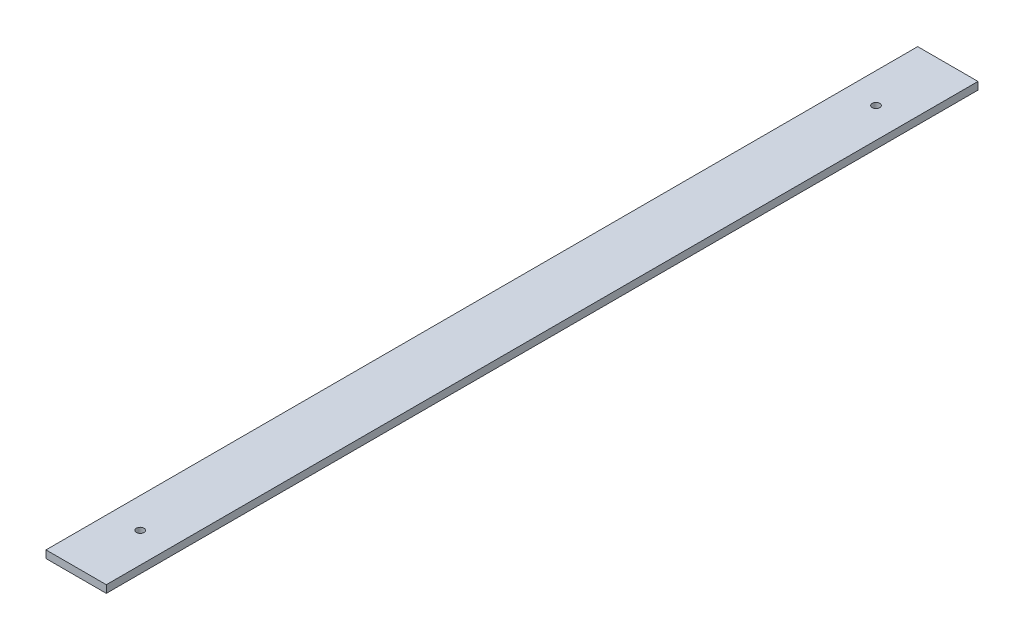
ISO-10303-21;
HEADER;
FILE_DESCRIPTION(('STEP AP214'),'2;1');
FILE_NAME('part.step','',(''),(''),'','','');
FILE_SCHEMA(('AUTOMOTIVE_DESIGN { 1 0 10303 214 1 1 1 1 }'));
ENDSEC;
DATA;
#1=APPLICATION_CONTEXT('core data for automotive mechanical design processes');
#2=APPLICATION_PROTOCOL_DEFINITION('international standard','automotive_design',2000,#1);
#3=PRODUCT_CONTEXT('',#1,'mechanical');
#4=PRODUCT('Part','Part','',(#3));
#5=PRODUCT_RELATED_PRODUCT_CATEGORY('part','',(#4));
#6=PRODUCT_DEFINITION_FORMATION('','',#4);
#7=PRODUCT_DEFINITION_CONTEXT('part definition',#1,'design');
#8=PRODUCT_DEFINITION('design','',#6,#7);
#9=PRODUCT_DEFINITION_SHAPE('','',#8);
#10=(LENGTH_UNIT() NAMED_UNIT(*) SI_UNIT(.MILLI.,.METRE.));
#11=(NAMED_UNIT(*) PLANE_ANGLE_UNIT() SI_UNIT($,.RADIAN.));
#12=(NAMED_UNIT(*) SI_UNIT($,.STERADIAN.) SOLID_ANGLE_UNIT());
#13=UNCERTAINTY_MEASURE_WITH_UNIT(LENGTH_MEASURE(1.E-05),#10,'distance_accuracy_value','');
#14=(GEOMETRIC_REPRESENTATION_CONTEXT(3) GLOBAL_UNCERTAINTY_ASSIGNED_CONTEXT((#13)) GLOBAL_UNIT_ASSIGNED_CONTEXT((#10,
#11,#12)) REPRESENTATION_CONTEXT('',''));
#15=CARTESIAN_POINT('',(0.,0.,0.));
#16=DIRECTION('',(0.,0.,1.));
#17=DIRECTION('',(1.,0.,0.));
#18=AXIS2_PLACEMENT_3D('',#15,#16,#17);
#19=CARTESIAN_POINT('',(0.,25.,0.));
#20=DIRECTION('',(0.,-1.,0.));
#21=DIRECTION('',(0.,0.,-1.));
#22=AXIS2_PLACEMENT_3D('',#19,#20,#21);
#23=PLANE('',#22);
#24=DIRECTION('',(0.,0.,-1.));
#25=VECTOR('',#24,1.);
#26=CARTESIAN_POINT('',(22132.9446458133,25.,9942.5828739722));
#27=LINE('',#26,#25);
#28=CARTESIAN_POINT('',(22132.9446458133,25.,12833.58379391));
#29=VERTEX_POINT('',#28);
#30=CARTESIAN_POINT('',(22132.9446458133,25.,9942.5828739722));
#31=VERTEX_POINT('',#30);
#32=EDGE_CURVE('E102',#29,#31,#27,.T.);
#33=ORIENTED_EDGE('',*,*,#32,.T.);
#34=DIRECTION('',(-1.,0.,0.));
#35=VECTOR('',#34,1.);
#36=CARTESIAN_POINT('',(22132.9446458133,25.,9942.5828739722));
#37=LINE('',#36,#35);
#38=CARTESIAN_POINT('',(21932.9446458133,25.,9942.5828739722));
#39=VERTEX_POINT('',#38);
#40=EDGE_CURVE('E97',#31,#39,#37,.T.);
#41=ORIENTED_EDGE('',*,*,#40,.T.);
#42=DIRECTION('',(0.,0.,1.));
#43=VECTOR('',#42,1.);
#44=CARTESIAN_POINT('',(21932.9446458133,25.,9942.5828739722));
#45=LINE('',#44,#43);
#46=CARTESIAN_POINT('',(21932.9446458133,25.,12833.58379391));
#47=VERTEX_POINT('',#46);
#48=EDGE_CURVE('E100',#39,#47,#45,.T.);
#49=ORIENTED_EDGE('',*,*,#48,.T.);
#50=DIRECTION('',(1.,0.,0.));
#51=VECTOR('',#50,1.);
#52=CARTESIAN_POINT('',(22132.9446458133,25.,12833.58379391));
#53=LINE('',#52,#51);
#54=EDGE_CURVE('E67',#47,#29,#53,.T.);
#55=ORIENTED_EDGE('',*,*,#54,.T.);
#56=EDGE_LOOP('',(#33,#41,#49,#55));
#57=FACE_BOUND('',#56,.T.);
#58=CARTESIAN_POINT('',(22032.9446458133,25.,12621.2282851754));
#59=DIRECTION('',(0.,1.,0.));
#60=DIRECTION('',(0.,0.,1.));
#61=AXIS2_PLACEMENT_3D('',#58,#59,#60);
#62=CIRCLE('',#61,12.4999999999988);
#63=CARTESIAN_POINT('',(22032.9446458133,25.,12633.7282851754));
#64=VERTEX_POINT('',#63);
#65=EDGE_CURVE('E117',#64,#64,#62,.T.);
#66=ORIENTED_EDGE('',*,*,#65,.F.);
#67=EDGE_LOOP('',(#66));
#68=FACE_BOUND('',#67,.T.);
#69=CARTESIAN_POINT('',(22032.9446458133,25.,10181.0304593336));
#70=DIRECTION('',(0.,1.,0.));
#71=DIRECTION('',(0.,0.,1.));
#72=AXIS2_PLACEMENT_3D('',#69,#70,#71);
#73=CIRCLE('',#72,12.4999999999988);
#74=CARTESIAN_POINT('',(22032.9446458133,25.,10193.5304593336));
#75=VERTEX_POINT('',#74);
#76=EDGE_CURVE('E132',#75,#75,#73,.T.);
#77=ORIENTED_EDGE('',*,*,#76,.F.);
#78=EDGE_LOOP('',(#77));
#79=FACE_BOUND('',#78,.T.);
#80=ADVANCED_FACE('F50',(#57,#68,#79),#23,.F.);
#81=CARTESIAN_POINT('',(0.,0.,0.));
#82=DIRECTION('',(0.,-1.,0.));
#83=DIRECTION('',(0.,0.,-1.));
#84=AXIS2_PLACEMENT_3D('',#81,#82,#83);
#85=PLANE('',#84);
#86=CARTESIAN_POINT('',(22032.9446458133,0.,12621.2282851754));
#87=DIRECTION('',(0.,1.,0.));
#88=DIRECTION('',(0.,0.,1.));
#89=AXIS2_PLACEMENT_3D('',#86,#87,#88);
#90=CIRCLE('',#89,12.4999999999988);
#91=CARTESIAN_POINT('',(22032.9446458133,0.,12633.7282851754));
#92=VERTEX_POINT('',#91);
#93=EDGE_CURVE('E129',#92,#92,#90,.T.);
#94=ORIENTED_EDGE('',*,*,#93,.T.);
#95=EDGE_LOOP('',(#94));
#96=FACE_BOUND('',#95,.T.);
#97=DIRECTION('',(0.,0.,-1.));
#98=VECTOR('',#97,1.);
#99=CARTESIAN_POINT('',(22132.9446458133,0.,9942.5828739722));
#100=LINE('',#99,#98);
#101=CARTESIAN_POINT('',(22132.9446458133,0.,12833.58379391));
#102=VERTEX_POINT('',#101);
#103=CARTESIAN_POINT('',(22132.9446458133,0.,9942.5828739722));
#104=VERTEX_POINT('',#103);
#105=EDGE_CURVE('E114',#102,#104,#100,.T.);
#106=ORIENTED_EDGE('',*,*,#105,.F.);
#107=DIRECTION('',(1.,0.,0.));
#108=VECTOR('',#107,1.);
#109=CARTESIAN_POINT('',(22132.9446458133,0.,12833.58379391));
#110=LINE('',#109,#108);
#111=CARTESIAN_POINT('',(21932.9446458133,0.,12833.58379391));
#112=VERTEX_POINT('',#111);
#113=EDGE_CURVE('E90',#112,#102,#110,.T.);
#114=ORIENTED_EDGE('',*,*,#113,.F.);
#115=DIRECTION('',(0.,0.,1.));
#116=VECTOR('',#115,1.);
#117=CARTESIAN_POINT('',(21932.9446458133,0.,9942.5828739722));
#118=LINE('',#117,#116);
#119=CARTESIAN_POINT('',(21932.9446458133,0.,9942.5828739722));
#120=VERTEX_POINT('',#119);
#121=EDGE_CURVE('E84',#120,#112,#118,.T.);
#122=ORIENTED_EDGE('',*,*,#121,.F.);
#123=DIRECTION('',(-1.,0.,0.));
#124=VECTOR('',#123,1.);
#125=CARTESIAN_POINT('',(22132.9446458133,0.,9942.5828739722));
#126=LINE('',#125,#124);
#127=EDGE_CURVE('E106',#104,#120,#126,.T.);
#128=ORIENTED_EDGE('',*,*,#127,.F.);
#129=EDGE_LOOP('',(#106,#114,#122,#128));
#130=FACE_BOUND('',#129,.T.);
#131=CARTESIAN_POINT('',(22032.9446458133,0.,10181.0304593336));
#132=DIRECTION('',(0.,1.,0.));
#133=DIRECTION('',(0.,0.,1.));
#134=AXIS2_PLACEMENT_3D('',#131,#132,#133);
#135=CIRCLE('',#134,12.4999999999988);
#136=CARTESIAN_POINT('',(22032.9446458133,0.,10193.5304593336));
#137=VERTEX_POINT('',#136);
#138=EDGE_CURVE('E135',#137,#137,#135,.T.);
#139=ORIENTED_EDGE('',*,*,#138,.T.);
#140=EDGE_LOOP('',(#139));
#141=FACE_BOUND('',#140,.T.);
#142=ADVANCED_FACE('F125',(#96,#130,#141),#85,.T.);
#143=CARTESIAN_POINT('',(22132.9446458133,25.,9942.5828739722));
#144=DIRECTION('',(-1.,0.,0.));
#145=DIRECTION('',(0.,0.,1.));
#146=AXIS2_PLACEMENT_3D('',#143,#144,#145);
#147=PLANE('',#146);
#148=ORIENTED_EDGE('',*,*,#105,.T.);
#149=DIRECTION('',(0.,-1.,0.));
#150=VECTOR('',#149,1.);
#151=CARTESIAN_POINT('',(22132.9446458133,25.,9942.5828739722));
#152=LINE('',#151,#150);
#153=EDGE_CURVE('E13',#31,#104,#152,.T.);
#154=ORIENTED_EDGE('',*,*,#153,.F.);
#155=ORIENTED_EDGE('',*,*,#32,.F.);
#156=DIRECTION('',(0.,-1.,0.));
#157=VECTOR('',#156,1.);
#158=CARTESIAN_POINT('',(22132.9446458133,25.,12833.58379391));
#159=LINE('',#158,#157);
#160=EDGE_CURVE('E110',#29,#102,#159,.T.);
#161=ORIENTED_EDGE('',*,*,#160,.T.);
#162=EDGE_LOOP('',(#148,#154,#155,#161));
#163=FACE_BOUND('',#162,.T.);
#164=ADVANCED_FACE('F52',(#163),#147,.F.);
#165=CARTESIAN_POINT('',(22132.9446458133,25.,9942.5828739722));
#166=DIRECTION('',(0.,0.,1.));
#167=DIRECTION('',(1.,0.,0.));
#168=AXIS2_PLACEMENT_3D('',#165,#166,#167);
#169=PLANE('',#168);
#170=ORIENTED_EDGE('',*,*,#127,.T.);
#171=DIRECTION('',(0.,-1.,0.));
#172=VECTOR('',#171,1.);
#173=CARTESIAN_POINT('',(21932.9446458133,25.,9942.5828739722));
#174=LINE('',#173,#172);
#175=EDGE_CURVE('E59',#39,#120,#174,.T.);
#176=ORIENTED_EDGE('',*,*,#175,.F.);
#177=ORIENTED_EDGE('',*,*,#40,.F.);
#178=ORIENTED_EDGE('',*,*,#153,.T.);
#179=EDGE_LOOP('',(#170,#176,#177,#178));
#180=FACE_BOUND('',#179,.T.);
#181=ADVANCED_FACE('F105',(#180),#169,.F.);
#182=CARTESIAN_POINT('',(21932.9446458133,25.,9942.5828739722));
#183=DIRECTION('',(1.,0.,0.));
#184=DIRECTION('',(0.,0.,-1.));
#185=AXIS2_PLACEMENT_3D('',#182,#183,#184);
#186=PLANE('',#185);
#187=ORIENTED_EDGE('',*,*,#121,.T.);
#188=DIRECTION('',(0.,-1.,0.));
#189=VECTOR('',#188,1.);
#190=CARTESIAN_POINT('',(21932.9446458133,25.,12833.58379391));
#191=LINE('',#190,#189);
#192=EDGE_CURVE('E107',#47,#112,#191,.T.);
#193=ORIENTED_EDGE('',*,*,#192,.F.);
#194=ORIENTED_EDGE('',*,*,#48,.F.);
#195=ORIENTED_EDGE('',*,*,#175,.T.);
#196=EDGE_LOOP('',(#187,#193,#194,#195));
#197=FACE_BOUND('',#196,.T.);
#198=ADVANCED_FACE('F108',(#197),#186,.F.);
#199=CARTESIAN_POINT('',(22132.9446458133,25.,12833.58379391));
#200=DIRECTION('',(0.,0.,-1.));
#201=DIRECTION('',(-1.,0.,0.));
#202=AXIS2_PLACEMENT_3D('',#199,#200,#201);
#203=PLANE('',#202);
#204=ORIENTED_EDGE('',*,*,#113,.T.);
#205=ORIENTED_EDGE('',*,*,#160,.F.);
#206=ORIENTED_EDGE('',*,*,#54,.F.);
#207=ORIENTED_EDGE('',*,*,#192,.T.);
#208=EDGE_LOOP('',(#204,#205,#206,#207));
#209=FACE_BOUND('',#208,.T.);
#210=ADVANCED_FACE('F122',(#209),#203,.F.);
#211=CARTESIAN_POINT('',(22032.9446458133,25.,12621.2282851754));
#212=DIRECTION('',(0.,-1.,0.));
#213=DIRECTION('',(0.,0.,-1.));
#214=AXIS2_PLACEMENT_3D('',#211,#212,#213);
#215=CYLINDRICAL_SURFACE('',#214,12.4999999999988);
#216=ORIENTED_EDGE('',*,*,#65,.T.);
#217=EDGE_LOOP('',(#216));
#218=FACE_BOUND('',#217,.T.);
#219=ORIENTED_EDGE('',*,*,#93,.F.);
#220=EDGE_LOOP('',(#219));
#221=FACE_BOUND('',#220,.T.);
#222=ADVANCED_FACE('F152',(#218,#221),#215,.F.);
#223=CARTESIAN_POINT('',(22032.9446458133,25.,10181.0304593336));
#224=DIRECTION('',(0.,-1.,0.));
#225=DIRECTION('',(0.,0.,-1.));
#226=AXIS2_PLACEMENT_3D('',#223,#224,#225);
#227=CYLINDRICAL_SURFACE('',#226,12.4999999999988);
#228=ORIENTED_EDGE('',*,*,#76,.T.);
#229=EDGE_LOOP('',(#228));
#230=FACE_BOUND('',#229,.T.);
#231=ORIENTED_EDGE('',*,*,#138,.F.);
#232=EDGE_LOOP('',(#231));
#233=FACE_BOUND('',#232,.T.);
#234=ADVANCED_FACE('F141',(#230,#233),#227,.F.);
#235=CLOSED_SHELL('',(#80,#142,#164,#181,#198,#210,#222,#234));
#236=MANIFOLD_SOLID_BREP('B2',#235);
#237=ADVANCED_BREP_SHAPE_REPRESENTATION('',(#18,#236),#14);
#238=SHAPE_DEFINITION_REPRESENTATION(#9,#237);
ENDSEC;
END-ISO-10303-21;
